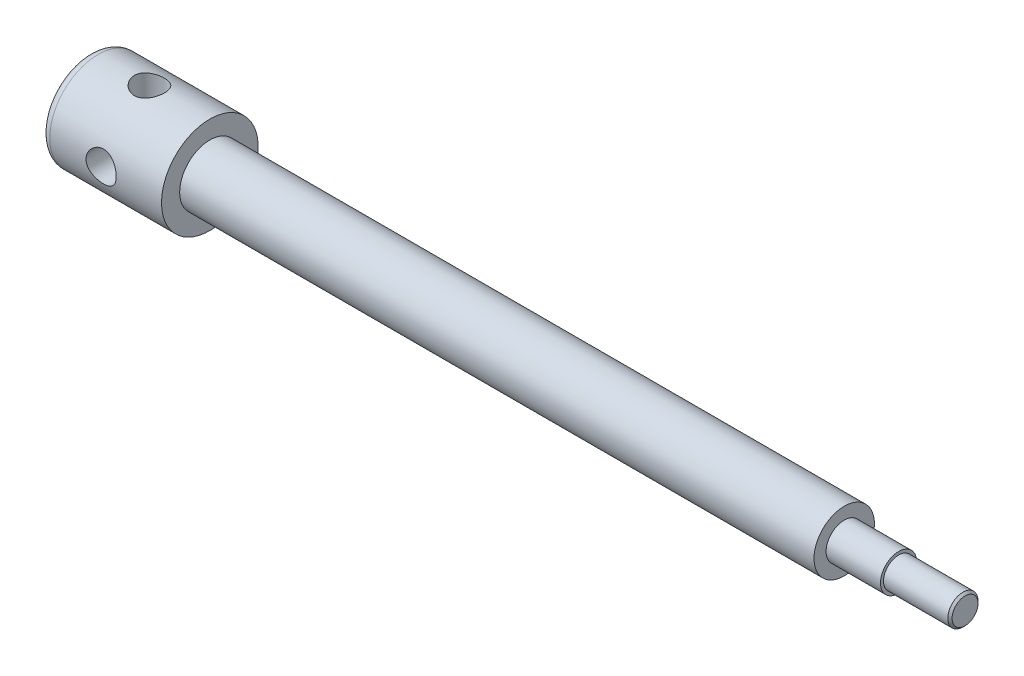
ISO-10303-21;
HEADER;
FILE_DESCRIPTION(('STEP AP214'),'2;1');
FILE_NAME('part.step','',(''),(''),'','','');
FILE_SCHEMA(('AUTOMOTIVE_DESIGN { 1 0 10303 214 1 1 1 1 }'));
ENDSEC;
DATA;
#1=APPLICATION_CONTEXT('core data for automotive mechanical design processes');
#2=APPLICATION_PROTOCOL_DEFINITION('international standard','automotive_design',2000,#1);
#3=PRODUCT_CONTEXT('',#1,'mechanical');
#4=PRODUCT('Part','Part','',(#3));
#5=PRODUCT_RELATED_PRODUCT_CATEGORY('part','',(#4));
#6=PRODUCT_DEFINITION_FORMATION('','',#4);
#7=PRODUCT_DEFINITION_CONTEXT('part definition',#1,'design');
#8=PRODUCT_DEFINITION('design','',#6,#7);
#9=PRODUCT_DEFINITION_SHAPE('','',#8);
#10=(LENGTH_UNIT() NAMED_UNIT(*) SI_UNIT(.MILLI.,.METRE.));
#11=(NAMED_UNIT(*) PLANE_ANGLE_UNIT() SI_UNIT($,.RADIAN.));
#12=(NAMED_UNIT(*) SI_UNIT($,.STERADIAN.) SOLID_ANGLE_UNIT());
#13=UNCERTAINTY_MEASURE_WITH_UNIT(LENGTH_MEASURE(1.E-05),#10,'distance_accuracy_value','');
#14=(GEOMETRIC_REPRESENTATION_CONTEXT(3) GLOBAL_UNCERTAINTY_ASSIGNED_CONTEXT((#13)) GLOBAL_UNIT_ASSIGNED_CONTEXT((#10,
#11,#12)) REPRESENTATION_CONTEXT('',''));
#15=CARTESIAN_POINT('',(0.,0.,0.));
#16=DIRECTION('',(0.,0.,1.));
#17=DIRECTION('',(1.,0.,0.));
#18=AXIS2_PLACEMENT_3D('',#15,#16,#17);
#19=CARTESIAN_POINT('',(-9.98454159103141,-50.,0.));
#20=DIRECTION('',(0.,1.,0.));
#21=DIRECTION('',(0.,0.,1.));
#22=AXIS2_PLACEMENT_3D('',#19,#20,#21);
#23=CYLINDRICAL_SURFACE('',#22,5.);
#24=CARTESIAN_POINT('',(-9.98454159103141,15.1986841535707,5.));
#25=CARTESIAN_POINT('',(-10.257929735483,15.1986858388479,4.99999815120853));
#26=CARTESIAN_POINT('',(-10.531336665848,15.206141260301,4.97750155166156));
#27=CARTESIAN_POINT('',(-11.0701182345388,15.2350255598558,4.8883670160513));
#28=CARTESIAN_POINT('',(-11.335490681959,15.2564582140989,4.82171715130012));
#29=CARTESIAN_POINT('',(-11.8503211987604,15.3106375534649,4.64679152894283));
#30=CARTESIAN_POINT('',(-12.0998065234544,15.3433642077798,4.5385894294672));
#31=CARTESIAN_POINT('',(-12.5771523744872,15.4164162487404,4.28387656692615));
#32=CARTESIAN_POINT('',(-12.8050090708718,15.4567429774317,4.13735903622524));
#33=CARTESIAN_POINT('',(-13.2404570610054,15.5420051067468,3.80478428248921));
#34=CARTESIAN_POINT('',(-13.4471960287754,15.5870449353917,3.6176375988816));
#35=CARTESIAN_POINT('',(-13.8269256438681,15.6757698344129,3.21144818582197));
#36=CARTESIAN_POINT('',(-13.9999115788108,15.7194547149049,2.99240101007426));
#37=CARTESIAN_POINT('',(-14.3109858430764,15.8017421356033,2.52250364997345));
#38=CARTESIAN_POINT('',(-14.4481964063572,15.8402073825112,2.27104622608038));
#39=CARTESIAN_POINT('',(-14.6780457904536,15.9065020733207,1.74721693141361));
#40=CARTESIAN_POINT('',(-14.7706950876298,15.9343340167968,1.47484999394821));
#41=CARTESIAN_POINT('',(-14.9059461034197,15.9754870328345,0.925857427864392));
#42=CARTESIAN_POINT('',(-14.9500045901828,15.9892295593657,0.649622861872864));
#43=CARTESIAN_POINT('',(-14.9914389767815,16.0021438350406,0.0933632559380779));
#44=CARTESIAN_POINT('',(-14.9888254884667,16.0013188964028,-0.186660907892346));
#45=CARTESIAN_POINT('',(-14.9379484246877,15.9854846453013,-0.732297921418927));
#46=CARTESIAN_POINT('',(-14.8912640569794,15.9709660388855,-0.998074537256133));
#47=CARTESIAN_POINT('',(-14.7561616308593,15.929979302435,-1.51781225339112));
#48=CARTESIAN_POINT('',(-14.6677408506849,15.9035103930884,-1.77177258192494));
#49=CARTESIAN_POINT('',(-14.4506608347322,15.8409383891783,-2.26431241261896));
#50=CARTESIAN_POINT('',(-14.3215223567804,15.8047213446668,-2.50266562249071));
#51=CARTESIAN_POINT('',(-14.0270571922121,15.7264689181539,-2.95481004460873));
#52=CARTESIAN_POINT('',(-13.8617213544759,15.6844320658262,-3.16859502483764));
#53=CARTESIAN_POINT('',(-13.4914470518306,15.5969468293413,-3.57495079381314));
#54=CARTESIAN_POINT('',(-13.285145315683,15.5514292793937,-3.76626619636764));
#55=CARTESIAN_POINT('',(-12.8429611837171,15.4636246177862,-4.11195897039057));
#56=CARTESIAN_POINT('',(-12.60707530867,15.4213378870279,-4.26633199104755));
#57=CARTESIAN_POINT('',(-12.1088717156411,15.3444338653158,-4.53521860076337));
#58=CARTESIAN_POINT('',(-11.8462879550675,15.3099076117639,-4.64926722799055));
#59=CARTESIAN_POINT('',(-11.3043036236634,15.253501811154,-4.83113383782183));
#60=CARTESIAN_POINT('',(-11.0249091342539,15.2316177207005,-4.89896843060006));
#61=CARTESIAN_POINT('',(-10.4692617807229,15.2039825362816,-4.9840594074562));
#62=CARTESIAN_POINT('',(-10.1933336060909,15.1976186557503,-5.00323817415589));
#63=CARTESIAN_POINT('',(-9.64218262505086,15.200043098397,-4.99586977992483));
#64=CARTESIAN_POINT('',(-9.36695971623275,15.2088290802927,-4.96932968445627));
#65=CARTESIAN_POINT('',(-8.83330840442172,15.2399582993567,-4.87299494052764));
#66=CARTESIAN_POINT('',(-8.57462449473461,15.2619021640805,-4.80447324642202));
#67=CARTESIAN_POINT('',(-8.07245442304808,15.3164514932552,-4.62761494644059));
#68=CARTESIAN_POINT('',(-7.82897074734688,15.3490586964925,-4.51927184684605));
#69=CARTESIAN_POINT('',(-7.35638515194418,15.4224215861294,-4.26230042623513));
#70=CARTESIAN_POINT('',(-7.12789592866025,15.4633841395902,-4.11260589954233));
#71=CARTESIAN_POINT('',(-6.69858020558381,15.5484139589123,-3.77842563471921));
#72=CARTESIAN_POINT('',(-6.49776091533008,15.5924820294279,-3.59393085876312));
#73=CARTESIAN_POINT('',(-6.12090012738014,15.6809675025074,-3.18629179101443));
#74=CARTESIAN_POINT('',(-5.94623044647195,15.7253236914272,-2.96186259915409));
#75=CARTESIAN_POINT('',(-5.6369774177464,15.8075623937471,-2.48580618260559));
#76=CARTESIAN_POINT('',(-5.50239223378727,15.8454452036378,-2.23418020443449));
#77=CARTESIAN_POINT('',(-5.27841934114469,15.9102524771405,-1.71242209332733));
#78=CARTESIAN_POINT('',(-5.18870443965668,15.937255982448,-1.44244073713503));
#79=CARTESIAN_POINT('',(-5.05625143667259,15.9776097059431,-0.890229016225556));
#80=CARTESIAN_POINT('',(-5.01349863469745,15.9909641965712,-0.608002513361416));
#81=CARTESIAN_POINT('',(-4.97737758403291,16.0022321361783,-0.0519397465956081));
#82=CARTESIAN_POINT('',(-4.98202779034833,16.0007651762951,0.221756767786049));
#83=CARTESIAN_POINT('',(-5.03578883522624,15.9840391232424,0.764292887693026));
#84=CARTESIAN_POINT('',(-5.08489677499939,15.9687809293064,1.03313280871841));
#85=CARTESIAN_POINT('',(-5.22491762792033,15.9263828337902,1.55502047392303));
#86=CARTESIAN_POINT('',(-5.31530002241222,15.899393918402,1.80822367379742));
#87=CARTESIAN_POINT('',(-5.53482489986599,15.8363178235242,2.29599370200086));
#88=CARTESIAN_POINT('',(-5.66397403092764,15.8002290836774,2.53055732509979));
#89=CARTESIAN_POINT('',(-5.96243262440656,15.7211958753111,2.98304677987682));
#90=CARTESIAN_POINT('',(-6.13295568087744,15.6780603899479,3.20013842820513));
#91=CARTESIAN_POINT('',(-6.50718114881514,15.590349461973,3.60328316560459));
#92=CARTESIAN_POINT('',(-6.71089348762582,15.5457735917315,3.78932693404399));
#93=CARTESIAN_POINT('',(-7.15380447036121,15.4584757027472,4.13131463642454));
#94=CARTESIAN_POINT('',(-7.3939552033608,15.4158640332118,4.28605711968617));
#95=CARTESIAN_POINT('',(-7.89813407198148,15.3392050100618,4.5528188298417));
#96=CARTESIAN_POINT('',(-8.16215249681869,15.3051541945183,4.66485533612217));
#97=CARTESIAN_POINT('',(-8.68343206030626,15.2522624175552,4.83484721745085));
#98=CARTESIAN_POINT('',(-8.93935178078733,15.2323726005924,4.89659759350261));
#99=CARTESIAN_POINT('',(-9.45835691934707,15.2055842579893,4.97916983261894));
#100=CARTESIAN_POINT('',(-9.72144055581366,15.1986825317074,5.00000177922474));
#101=CARTESIAN_POINT('',(-9.98454159103141,15.1986841535707,5.));
#102=B_SPLINE_CURVE_WITH_KNOTS('',3,(#24,#25,#26,#27,#28,#29,#30,#31,#32,#33,#34,#35,#36,#37,
#38,#39,#40,#41,#42,#43,#44,#45,#46,#47,#48,#49,#50,#51,#52,#53,#54,#55,#56,#57,#58,#59,#60,#61,
#62,#63,#64,#65,#66,#67,#68,#69,#70,#71,#72,#73,#74,#75,#76,#77,#78,#79,#80,#81,#82,#83,#84,#85,
#86,#87,#88,#89,#90,#91,#92,#93,#94,#95,#96,#97,#98,#99,#100,#101),.UNSPECIFIED.,.T.,.F.,(4,2,2,
2,2,2,2,2,2,2,2,2,2,2,2,2,2,2,2,2,2,2,2,2,2,2,2,2,2,2,2,2,2,2,2,2,2,2,4),(0.,0.819192550193962,
1.63860650823894,2.45657457647433,3.27468721969979,4.11828322203353,4.96199691764491,
5.82479287854933,6.68738589671688,7.52334891342135,8.35912185887098,9.16603931879003,
9.97300940760373,10.7898561843364,11.6069097085275,12.4580135574934,13.309217594151,
14.1699388374229,15.0303505582074,15.8561973316147,16.6819164888609,17.4837588818718,
18.2857320902257,19.1107045324817,19.9358915205725,20.7952775125577,21.6546241327807,
22.5076095717372,23.3603279257207,24.1775520976783,24.9947229877895,25.8016738606877,
26.6087631965634,27.4432277243059,28.2779423109849,29.1403118201788,30.002332032282,
30.7908941750129,31.5792619677388),.UNSPECIFIED.);
#103=CARTESIAN_POINT('',(-9.98454159103141,15.1986841535707,5.));
#104=VERTEX_POINT('',#103);
#105=EDGE_CURVE('E78',#104,#104,#102,.T.);
#106=ORIENTED_EDGE('',*,*,#105,.F.);
#107=EDGE_LOOP('',(#106));
#108=FACE_BOUND('',#107,.T.);
#109=CARTESIAN_POINT('',(-9.98454159103141,0.,0.));
#110=DIRECTION('',(0.,0.707106781186547,-0.707106781186547));
#111=DIRECTION('',(0.,0.707106781186547,0.707106781186547));
#112=AXIS2_PLACEMENT_3D('',#109,#110,#111);
#113=ELLIPSE('',#112,7.07106781186547,5.);
#114=CARTESIAN_POINT('',(-4.98454159103141,0.,0.));
#115=VERTEX_POINT('',#114);
#116=CARTESIAN_POINT('',(-14.9845415910314,0.,0.));
#117=VERTEX_POINT('',#116);
#118=EDGE_CURVE('E50',#115,#117,#113,.F.);
#119=ORIENTED_EDGE('',*,*,#118,.T.);
#120=CARTESIAN_POINT('',(-9.98454159103141,0.,0.));
#121=DIRECTION('',(0.,0.707106781186547,0.707106781186547));
#122=DIRECTION('',(0.,0.707106781186547,-0.707106781186547));
#123=AXIS2_PLACEMENT_3D('',#120,#121,#122);
#124=ELLIPSE('',#123,7.07106781186547,5.);
#125=EDGE_CURVE('E11',#117,#115,#124,.F.);
#126=ORIENTED_EDGE('',*,*,#125,.T.);
#127=EDGE_LOOP('',(#119,#126));
#128=FACE_BOUND('',#127,.T.);
#129=ADVANCED_FACE('F37',(#108,#128),#23,.F.);
#130=CARTESIAN_POINT('',(260.015458408969,4.29289321881348,0.));
#131=DIRECTION('',(-1.,0.,0.));
#132=DIRECTION('',(0.,0.,1.));
#133=AXIS2_PLACEMENT_3D('',#130,#131,#132);
#134=PLANE('',#133);
#135=CARTESIAN_POINT('',(260.015458408969,0.,0.));
#136=DIRECTION('',(-1.,0.,0.));
#137=DIRECTION('',(0.,0.,1.));
#138=AXIS2_PLACEMENT_3D('',#135,#136,#137);
#139=CIRCLE('',#138,4.29289321881348);
#140=CARTESIAN_POINT('',(260.015458408969,0.,4.29289321881348));
#141=VERTEX_POINT('',#140);
#142=EDGE_CURVE('E65',#141,#141,#139,.T.);
#143=ORIENTED_EDGE('',*,*,#142,.F.);
#144=EDGE_LOOP('',(#143));
#145=FACE_BOUND('',#144,.T.);
#146=ADVANCED_FACE('F39',(#145),#134,.F.);
#147=CARTESIAN_POINT('',(260.015458408969,0.,0.));
#148=DIRECTION('',(-1.,0.,0.));
#149=DIRECTION('',(0.,0.,1.));
#150=AXIS2_PLACEMENT_3D('',#147,#148,#149);
#151=CONICAL_SURFACE('',#150,4.29289321881348,0.785398163397389);
#152=CARTESIAN_POINT('',(259.308351627782,0.,0.));
#153=DIRECTION('',(-1.,0.,0.));
#154=DIRECTION('',(0.,0.,1.));
#155=AXIS2_PLACEMENT_3D('',#152,#153,#154);
#156=CIRCLE('',#155,5.00000000000002);
#157=CARTESIAN_POINT('',(259.308351627782,0.,5.00000000000002));
#158=VERTEX_POINT('',#157);
#159=EDGE_CURVE('E150',#158,#158,#156,.T.);
#160=ORIENTED_EDGE('',*,*,#159,.F.);
#161=EDGE_LOOP('',(#160));
#162=FACE_BOUND('',#161,.T.);
#163=ORIENTED_EDGE('',*,*,#142,.T.);
#164=EDGE_LOOP('',(#163));
#165=FACE_BOUND('',#164,.T.);
#166=ADVANCED_FACE('F110',(#162,#165),#151,.T.);
#167=CARTESIAN_POINT('',(-31.9453644398088,0.,0.));
#168=DIRECTION('',(-1.,0.,0.));
#169=DIRECTION('',(0.,0.,1.));
#170=AXIS2_PLACEMENT_3D('',#167,#168,#169);
#171=CYLINDRICAL_SURFACE('',#170,5.00000000000001);
#172=CARTESIAN_POINT('',(238.015458408969,0.,0.));
#173=DIRECTION('',(-1.,0.,0.));
#174=DIRECTION('',(0.,0.,1.));
#175=AXIS2_PLACEMENT_3D('',#172,#173,#174);
#176=CIRCLE('',#175,5.);
#177=CARTESIAN_POINT('',(238.015458408969,0.,5.));
#178=VERTEX_POINT('',#177);
#179=EDGE_CURVE('E147',#178,#178,#176,.T.);
#180=ORIENTED_EDGE('',*,*,#179,.F.);
#181=EDGE_LOOP('',(#180));
#182=FACE_BOUND('',#181,.T.);
#183=ORIENTED_EDGE('',*,*,#159,.T.);
#184=EDGE_LOOP('',(#183));
#185=FACE_BOUND('',#184,.T.);
#186=ADVANCED_FACE('F156',(#182,#185),#171,.T.);
#187=CARTESIAN_POINT('',(238.015458408969,6.,0.));
#188=DIRECTION('',(-1.,0.,0.));
#189=DIRECTION('',(0.,0.,1.));
#190=AXIS2_PLACEMENT_3D('',#187,#188,#189);
#191=PLANE('',#190);
#192=CARTESIAN_POINT('',(238.015458408969,0.,0.));
#193=DIRECTION('',(-1.,0.,0.));
#194=DIRECTION('',(0.,0.,1.));
#195=AXIS2_PLACEMENT_3D('',#192,#193,#194);
#196=CIRCLE('',#195,6.);
#197=CARTESIAN_POINT('',(238.015458408969,0.,6.));
#198=VERTEX_POINT('',#197);
#199=EDGE_CURVE('E144',#198,#198,#196,.T.);
#200=ORIENTED_EDGE('',*,*,#199,.F.);
#201=EDGE_LOOP('',(#200));
#202=FACE_BOUND('',#201,.T.);
#203=ORIENTED_EDGE('',*,*,#179,.T.);
#204=EDGE_LOOP('',(#203));
#205=FACE_BOUND('',#204,.T.);
#206=ADVANCED_FACE('F161',(#202,#205),#191,.F.);
#207=CARTESIAN_POINT('',(-31.9453644398088,0.,0.));
#208=DIRECTION('',(-1.,0.,0.));
#209=DIRECTION('',(0.,0.,1.));
#210=AXIS2_PLACEMENT_3D('',#207,#208,#209);
#211=CYLINDRICAL_SURFACE('',#210,6.);
#212=CARTESIAN_POINT('',(220.015458408969,0.,0.));
#213=DIRECTION('',(-1.,0.,0.));
#214=DIRECTION('',(0.,0.,1.));
#215=AXIS2_PLACEMENT_3D('',#212,#213,#214);
#216=CIRCLE('',#215,6.);
#217=CARTESIAN_POINT('',(220.015458408969,0.,6.));
#218=VERTEX_POINT('',#217);
#219=EDGE_CURVE('E141',#218,#218,#216,.T.);
#220=ORIENTED_EDGE('',*,*,#219,.F.);
#221=EDGE_LOOP('',(#220));
#222=FACE_BOUND('',#221,.T.);
#223=ORIENTED_EDGE('',*,*,#199,.T.);
#224=EDGE_LOOP('',(#223));
#225=FACE_BOUND('',#224,.T.);
#226=ADVANCED_FACE('F168',(#222,#225),#211,.T.);
#227=CARTESIAN_POINT('',(220.015458408969,6.,0.));
#228=DIRECTION('',(-1.,0.,0.));
#229=DIRECTION('',(0.,0.,1.));
#230=AXIS2_PLACEMENT_3D('',#227,#228,#229);
#231=PLANE('',#230);
#232=CARTESIAN_POINT('',(220.015458408969,0.,0.));
#233=DIRECTION('',(-1.,0.,0.));
#234=DIRECTION('',(0.,0.,1.));
#235=AXIS2_PLACEMENT_3D('',#232,#233,#234);
#236=CIRCLE('',#235,9.99835911782587);
#237=CARTESIAN_POINT('',(220.015458408969,0.,9.99835911782587));
#238=VERTEX_POINT('',#237);
#239=EDGE_CURVE('E138',#238,#238,#236,.T.);
#240=ORIENTED_EDGE('',*,*,#239,.F.);
#241=EDGE_LOOP('',(#240));
#242=FACE_BOUND('',#241,.T.);
#243=ORIENTED_EDGE('',*,*,#219,.T.);
#244=EDGE_LOOP('',(#243));
#245=FACE_BOUND('',#244,.T.);
#246=ADVANCED_FACE('F172',(#242,#245),#231,.F.);
#247=CARTESIAN_POINT('',(-31.9453644398088,0.,0.));
#248=DIRECTION('',(-1.,0.,0.));
#249=DIRECTION('',(0.,0.,1.));
#250=AXIS2_PLACEMENT_3D('',#247,#248,#249);
#251=CYLINDRICAL_SURFACE('',#250,9.99835911782585);
#252=CARTESIAN_POINT('',(10.0154584089686,0.,0.));
#253=DIRECTION('',(-1.,0.,0.));
#254=DIRECTION('',(0.,0.,1.));
#255=AXIS2_PLACEMENT_3D('',#252,#253,#254);
#256=CIRCLE('',#255,9.99835911782584);
#257=CARTESIAN_POINT('',(10.0154584089686,0.,9.99835911782584));
#258=VERTEX_POINT('',#257);
#259=EDGE_CURVE('E135',#258,#258,#256,.T.);
#260=ORIENTED_EDGE('',*,*,#259,.F.);
#261=EDGE_LOOP('',(#260));
#262=FACE_BOUND('',#261,.T.);
#263=ORIENTED_EDGE('',*,*,#239,.T.);
#264=EDGE_LOOP('',(#263));
#265=FACE_BOUND('',#264,.T.);
#266=ADVANCED_FACE('F176',(#262,#265),#251,.T.);
#267=CARTESIAN_POINT('',(10.0154584089686,9.99835911782584,0.));
#268=DIRECTION('',(-1.,0.,0.));
#269=DIRECTION('',(0.,0.,1.));
#270=AXIS2_PLACEMENT_3D('',#267,#268,#269);
#271=PLANE('',#270);
#272=CARTESIAN_POINT('',(10.0154584089686,0.,0.));
#273=DIRECTION('',(-1.,0.,0.));
#274=DIRECTION('',(0.,0.,1.));
#275=AXIS2_PLACEMENT_3D('',#272,#273,#274);
#276=CIRCLE('',#275,16.);
#277=CARTESIAN_POINT('',(10.0154584089686,0.,16.));
#278=VERTEX_POINT('',#277);
#279=EDGE_CURVE('E132',#278,#278,#276,.T.);
#280=ORIENTED_EDGE('',*,*,#279,.F.);
#281=EDGE_LOOP('',(#280));
#282=FACE_BOUND('',#281,.T.);
#283=ORIENTED_EDGE('',*,*,#259,.T.);
#284=EDGE_LOOP('',(#283));
#285=FACE_BOUND('',#284,.T.);
#286=ADVANCED_FACE('F101',(#282,#285),#271,.F.);
#287=CARTESIAN_POINT('',(-31.9453644398088,0.,0.));
#288=DIRECTION('',(-1.,0.,0.));
#289=DIRECTION('',(0.,0.,1.));
#290=AXIS2_PLACEMENT_3D('',#287,#288,#289);
#291=CYLINDRICAL_SURFACE('',#290,16.);
#292=CARTESIAN_POINT('',(-4.98454159103141,0.,16.));
#293=CARTESIAN_POINT('',(-4.98454337738171,-0.273756740698179,15.9999986351195));
#294=CARTESIAN_POINT('',(-5.00709849880919,-0.54753221001141,15.9929077993933));
#295=CARTESIAN_POINT('',(-5.0964865571884,-1.08707683835382,15.9653157635526));
#296=CARTESIAN_POINT('',(-5.16332951648899,-1.35284417090373,15.9448115279957));
#297=CARTESIAN_POINT('',(-5.33881907581422,-1.86851417460313,15.892632627915));
#298=CARTESIAN_POINT('',(-5.44740096964276,-2.11844070794284,15.860975259956));
#299=CARTESIAN_POINT('',(-5.70301086174525,-2.59653920938622,15.7897587664487));
#300=CARTESIAN_POINT('',(-5.85004491815572,-2.82470774178094,15.7501983960149));
#301=CARTESIAN_POINT('',(-6.18316555909884,-3.25986133980768,15.6660085495921));
#302=CARTESIAN_POINT('',(-6.3702251312681,-3.46608011262119,15.621268637007));
#303=CARTESIAN_POINT('',(-6.77601516069321,-3.84478952815342,15.5324018550409));
#304=CARTESIAN_POINT('',(-6.99475150103799,-4.01727389161514,15.4882751012093));
#305=CARTESIAN_POINT('',(-7.46431984623873,-4.32777345930637,15.4044457876484));
#306=CARTESIAN_POINT('',(-7.71581150103912,-4.4648313659311,15.3648795310221));
#307=CARTESIAN_POINT('',(-8.23971085085404,-4.69438964299238,15.2963120709366));
#308=CARTESIAN_POINT('',(-8.51211301417483,-4.78690175085853,15.2673080849026));
#309=CARTESIAN_POINT('',(-9.06145390086511,-4.92193839721856,15.224304279618));
#310=CARTESIAN_POINT('',(-9.33800896559961,-4.96588440031618,15.2098789171452));
#311=CARTESIAN_POINT('',(-9.89491406666621,-5.00698220147793,15.1964022056731));
#312=CARTESIAN_POINT('',(-10.1752630742924,-5.00414643984172,15.1973467694717));
#313=CARTESIAN_POINT('',(-10.7200394321425,-4.95287298929817,15.2141275626545));
#314=CARTESIAN_POINT('',(-10.9846580945834,-4.90624231472934,15.2293736684469));
#315=CARTESIAN_POINT('',(-11.5021102172804,-4.77163253417961,15.272081024701));
#316=CARTESIAN_POINT('',(-11.7549424218897,-4.68364903377187,15.2995435733467));
#317=CARTESIAN_POINT('',(-12.2459493687298,-4.46755498726522,15.3640417609541));
#318=CARTESIAN_POINT('',(-12.4838560337907,-4.33887702648707,15.4012113865356));
#319=CARTESIAN_POINT('',(-12.9352926625565,-4.04544082951013,15.4808742631002));
#320=CARTESIAN_POINT('',(-13.1488162720486,-3.88067322086205,15.523368895754));
#321=CARTESIAN_POINT('',(-13.5556413646969,-3.51086781672958,15.6112611120491));
#322=CARTESIAN_POINT('',(-13.7475798221495,-3.30433828237156,15.6567027842357));
#323=CARTESIAN_POINT('',(-14.0944291653508,-2.86145763238183,15.7436628303753));
#324=CARTESIAN_POINT('',(-14.2493373079084,-2.625104309396,15.7851809135328));
#325=CARTESIAN_POINT('',(-14.5186523454363,-2.12665844186189,15.8600517956098));
#326=CARTESIAN_POINT('',(-14.6327341328872,-1.86437962767714,15.8933384259289));
#327=CARTESIAN_POINT('',(-14.8147535944377,-1.32307191113056,15.9475182331416));
#328=CARTESIAN_POINT('',(-14.882705279985,-1.04404812289843,15.9684151730059));
#329=CARTESIAN_POINT('',(-14.9682137613473,-0.488740629161383,15.9948555758007));
#330=CARTESIAN_POINT('',(-14.9876157654055,-0.212767395155372,16.0009609158175));
#331=CARTESIAN_POINT('',(-14.9806766844821,0.338521222930347,15.9987919892393));
#332=CARTESIAN_POINT('',(-14.954342281741,0.613836697226038,15.9905198232454));
#333=CARTESIAN_POINT('',(-14.8581592206059,1.1488773319034,15.9608945507905));
#334=CARTESIAN_POINT('',(-14.7894085205815,1.40881991368375,15.9398717244275));
#335=CARTESIAN_POINT('',(-14.6116841815646,1.91340771544551,15.8872048551716));
#336=CARTESIAN_POINT('',(-14.5027055749314,2.15805104179624,15.8555595005737));
#337=CARTESIAN_POINT('',(-14.2446487248367,2.63172962668875,15.783941710377));
#338=CARTESIAN_POINT('',(-14.0946576410442,2.86023895915116,15.7437850727067));
#339=CARTESIAN_POINT('',(-13.7599287505617,3.28946340384104,15.6597364001372));
#340=CARTESIAN_POINT('',(-13.5751815200528,3.4901709521758,15.6158433539155));
#341=CARTESIAN_POINT('',(-13.167506030823,3.86634985167608,15.5270797953257));
#342=CARTESIAN_POINT('',(-12.9433549360745,4.04050609358125,15.4822394682577));
#343=CARTESIAN_POINT('',(-12.4680351255243,4.34885000980606,15.3984778838242));
#344=CARTESIAN_POINT('',(-12.2168668389235,4.48303831893719,15.3595565324524));
#345=CARTESIAN_POINT('',(-11.6951608995495,4.70680333922169,15.2924712932348));
#346=CARTESIAN_POINT('',(-11.4247029932885,4.7965527822405,15.264265854275));
#347=CARTESIAN_POINT('',(-10.8714516180369,4.92891577272361,15.2220468337724));
#348=CARTESIAN_POINT('',(-10.5886628856573,4.97154725655978,15.2080278520491));
#349=CARTESIAN_POINT('',(-10.0325252407097,5.00717624632503,15.1963317085551));
#350=CARTESIAN_POINT('',(-9.75932777564174,5.00233118486543,15.1979441840057));
#351=CARTESIAN_POINT('',(-9.21784325126366,4.94835272515335,15.2156036150361));
#352=CARTESIAN_POINT('',(-8.94955596348447,4.89922139290048,15.2316498972642));
#353=CARTESIAN_POINT('',(-8.42936543266384,4.7595091965447,15.2758725673356));
#354=CARTESIAN_POINT('',(-8.17727982665797,4.66954569624033,15.3038679276103));
#355=CARTESIAN_POINT('',(-7.69157993689539,4.45120909339998,15.3687881701826));
#356=CARTESIAN_POINT('',(-7.45796942271779,4.32282817776947,15.4057148685869));
#357=CARTESIAN_POINT('',(-7.00595770927216,4.02542700053973,15.4861394813401));
#358=CARTESIAN_POINT('',(-6.78850907303046,3.85501334096529,15.5298379569183));
#359=CARTESIAN_POINT('',(-6.38459627858342,3.4808359856192,15.6179599528484));
#360=CARTESIAN_POINT('',(-6.19814043506718,3.27706336937756,15.6623836642662));
#361=CARTESIAN_POINT('',(-5.85541143757969,2.83394665129338,15.7486908780989));
#362=CARTESIAN_POINT('',(-5.70032264523161,2.59365829794954,15.7904440692269));
#363=CARTESIAN_POINT('',(-5.4329459304736,2.0891165520546,15.8650707718751));
#364=CARTESIAN_POINT('',(-5.32064118246407,1.82487263118179,15.8979477726329));
#365=CARTESIAN_POINT('',(-5.15017612059756,1.30299054149591,15.9488260293388));
#366=CARTESIAN_POINT('',(-5.08824212181006,1.04668134845018,15.9678496322456));
#367=CARTESIAN_POINT('',(-5.00542815116056,0.526919581760987,15.9934360136194));
#368=CARTESIAN_POINT('',(-4.98453987181541,0.263468464558691,16.0000013135858));
#369=CARTESIAN_POINT('',(-4.98454159103141,0.,16.));
#370=B_SPLINE_CURVE_WITH_KNOTS('',3,(#292,#293,#294,#295,#296,#297,#298,#299,#300,#301,#302,
#303,#304,#305,#306,#307,#308,#309,#310,#311,#312,#313,#314,#315,#316,#317,#318,#319,#320,#321,
#322,#323,#324,#325,#326,#327,#328,#329,#330,#331,#332,#333,#334,#335,#336,#337,#338,#339,#340,
#341,#342,#343,#344,#345,#346,#347,#348,#349,#350,#351,#352,#353,#354,#355,#356,#357,#358,#359,
#360,#361,#362,#363,#364,#365,#366,#367,#368,#369),.UNSPECIFIED.,.T.,.F.,(4,2,2,2,2,2,2,2,2,2,2,
2,2,2,2,2,2,2,2,2,2,2,2,2,2,2,2,2,2,2,2,2,2,2,2,2,2,2,4),(0.,0.82030179773004,1.64078929339627,
2.46000991680975,3.27935968623357,4.12151288780633,4.96382269725105,5.82695084991452,
6.68985145121464,7.52676600672195,8.36345801183909,9.16707669695194,9.97078079925601,
10.7862257089153,11.6018826405078,12.4546698912775,13.3075202966256,14.1670184276843,
15.0262553798757,15.852302742023,16.678229426068,17.4836250690084,18.2891202014735,
19.1142529896272,19.9396098284639,20.7976711486191,21.655718839442,22.5104046302277,
23.3647649559871,24.1804881394266,24.9961732705188,25.7999165363423,26.6038233736824,
27.4391805607299,28.274761495409,29.1376267255319,30.0001522671289,30.7897854665371,
31.5792588309973),.UNSPECIFIED.);
#371=CARTESIAN_POINT('',(-4.98454159103141,0.,16.));
#372=VERTEX_POINT('',#371);
#373=EDGE_CURVE('E115',#372,#372,#370,.T.);
#374=ORIENTED_EDGE('',*,*,#373,.T.);
#375=EDGE_LOOP('',(#374));
#376=FACE_BOUND('',#375,.T.);
#377=CARTESIAN_POINT('',(-4.98454159103141,0.,-16.));
#378=CARTESIAN_POINT('',(-4.98454337738171,0.273756740698179,-15.9999986351195));
#379=CARTESIAN_POINT('',(-5.00709849880919,0.54753221001141,-15.9929077993933));
#380=CARTESIAN_POINT('',(-5.0964865571884,1.08707683835382,-15.9653157635526));
#381=CARTESIAN_POINT('',(-5.16332951648899,1.35284417090373,-15.9448115279957));
#382=CARTESIAN_POINT('',(-5.33881907581422,1.86851417460313,-15.892632627915));
#383=CARTESIAN_POINT('',(-5.44740096964276,2.11844070794284,-15.860975259956));
#384=CARTESIAN_POINT('',(-5.70301086174525,2.59653920938622,-15.7897587664487));
#385=CARTESIAN_POINT('',(-5.85004491815572,2.82470774178094,-15.7501983960149));
#386=CARTESIAN_POINT('',(-6.18316555909884,3.25986133980768,-15.6660085495921));
#387=CARTESIAN_POINT('',(-6.3702251312681,3.46608011262119,-15.621268637007));
#388=CARTESIAN_POINT('',(-6.77601516069321,3.84478952815342,-15.5324018550409));
#389=CARTESIAN_POINT('',(-6.99475150103799,4.01727389161514,-15.4882751012093));
#390=CARTESIAN_POINT('',(-7.46431984623873,4.32777345930637,-15.4044457876484));
#391=CARTESIAN_POINT('',(-7.71581150103912,4.4648313659311,-15.3648795310221));
#392=CARTESIAN_POINT('',(-8.23971085085404,4.69438964299238,-15.2963120709366));
#393=CARTESIAN_POINT('',(-8.51211301417483,4.78690175085853,-15.2673080849026));
#394=CARTESIAN_POINT('',(-9.06145390086511,4.92193839721856,-15.224304279618));
#395=CARTESIAN_POINT('',(-9.33800896559961,4.96588440031618,-15.2098789171452));
#396=CARTESIAN_POINT('',(-9.89491406666621,5.00698220147793,-15.1964022056731));
#397=CARTESIAN_POINT('',(-10.1752630742924,5.00414643984172,-15.1973467694717));
#398=CARTESIAN_POINT('',(-10.7200394321425,4.95287298929817,-15.2141275626545));
#399=CARTESIAN_POINT('',(-10.9846580945834,4.90624231472934,-15.2293736684469));
#400=CARTESIAN_POINT('',(-11.5021102172804,4.77163253417961,-15.272081024701));
#401=CARTESIAN_POINT('',(-11.7549424218897,4.68364903377187,-15.2995435733467));
#402=CARTESIAN_POINT('',(-12.2459493687298,4.46755498726522,-15.3640417609541));
#403=CARTESIAN_POINT('',(-12.4838560337907,4.33887702648707,-15.4012113865356));
#404=CARTESIAN_POINT('',(-12.9352926625565,4.04544082951013,-15.4808742631002));
#405=CARTESIAN_POINT('',(-13.1488162720486,3.88067322086205,-15.523368895754));
#406=CARTESIAN_POINT('',(-13.5556413646969,3.51086781672958,-15.6112611120491));
#407=CARTESIAN_POINT('',(-13.7475798221495,3.30433828237156,-15.6567027842357));
#408=CARTESIAN_POINT('',(-14.0944291653508,2.86145763238183,-15.7436628303753));
#409=CARTESIAN_POINT('',(-14.2493373079084,2.625104309396,-15.7851809135328));
#410=CARTESIAN_POINT('',(-14.5186523454363,2.12665844186189,-15.8600517956098));
#411=CARTESIAN_POINT('',(-14.6327341328872,1.86437962767714,-15.8933384259289));
#412=CARTESIAN_POINT('',(-14.8147535944377,1.32307191113056,-15.9475182331416));
#413=CARTESIAN_POINT('',(-14.882705279985,1.04404812289843,-15.9684151730059));
#414=CARTESIAN_POINT('',(-14.9682137613473,0.488740629161383,-15.9948555758007));
#415=CARTESIAN_POINT('',(-14.9876157654055,0.212767395155372,-16.0009609158175));
#416=CARTESIAN_POINT('',(-14.9806766844821,-0.338521222930347,-15.9987919892393));
#417=CARTESIAN_POINT('',(-14.954342281741,-0.613836697226038,-15.9905198232454));
#418=CARTESIAN_POINT('',(-14.8581592206059,-1.1488773319034,-15.9608945507905));
#419=CARTESIAN_POINT('',(-14.7894085205815,-1.40881991368375,-15.9398717244275));
#420=CARTESIAN_POINT('',(-14.6116841815646,-1.91340771544551,-15.8872048551716));
#421=CARTESIAN_POINT('',(-14.5027055749314,-2.15805104179624,-15.8555595005737));
#422=CARTESIAN_POINT('',(-14.2446487248367,-2.63172962668875,-15.783941710377));
#423=CARTESIAN_POINT('',(-14.0946576410442,-2.86023895915116,-15.7437850727067));
#424=CARTESIAN_POINT('',(-13.7599287505617,-3.28946340384104,-15.6597364001372));
#425=CARTESIAN_POINT('',(-13.5751815200528,-3.4901709521758,-15.6158433539155));
#426=CARTESIAN_POINT('',(-13.167506030823,-3.86634985167608,-15.5270797953257));
#427=CARTESIAN_POINT('',(-12.9433549360745,-4.04050609358125,-15.4822394682577));
#428=CARTESIAN_POINT('',(-12.4680351255243,-4.34885000980606,-15.3984778838242));
#429=CARTESIAN_POINT('',(-12.2168668389235,-4.48303831893719,-15.3595565324524));
#430=CARTESIAN_POINT('',(-11.6951608995495,-4.70680333922169,-15.2924712932348));
#431=CARTESIAN_POINT('',(-11.4247029932885,-4.7965527822405,-15.264265854275));
#432=CARTESIAN_POINT('',(-10.8714516180369,-4.92891577272361,-15.2220468337724));
#433=CARTESIAN_POINT('',(-10.5886628856573,-4.97154725655978,-15.2080278520491));
#434=CARTESIAN_POINT('',(-10.0325252407097,-5.00717624632503,-15.1963317085551));
#435=CARTESIAN_POINT('',(-9.75932777564174,-5.00233118486543,-15.1979441840057));
#436=CARTESIAN_POINT('',(-9.21784325126366,-4.94835272515335,-15.2156036150361));
#437=CARTESIAN_POINT('',(-8.94955596348447,-4.89922139290048,-15.2316498972642));
#438=CARTESIAN_POINT('',(-8.42936543266384,-4.7595091965447,-15.2758725673356));
#439=CARTESIAN_POINT('',(-8.17727982665797,-4.66954569624033,-15.3038679276103));
#440=CARTESIAN_POINT('',(-7.69157993689539,-4.45120909339998,-15.3687881701826));
#441=CARTESIAN_POINT('',(-7.45796942271779,-4.32282817776947,-15.4057148685869));
#442=CARTESIAN_POINT('',(-7.00595770927216,-4.02542700053973,-15.4861394813401));
#443=CARTESIAN_POINT('',(-6.78850907303046,-3.85501334096529,-15.5298379569183));
#444=CARTESIAN_POINT('',(-6.38459627858342,-3.4808359856192,-15.6179599528484));
#445=CARTESIAN_POINT('',(-6.19814043506718,-3.27706336937756,-15.6623836642662));
#446=CARTESIAN_POINT('',(-5.85541143757969,-2.83394665129338,-15.7486908780989));
#447=CARTESIAN_POINT('',(-5.70032264523161,-2.59365829794954,-15.7904440692269));
#448=CARTESIAN_POINT('',(-5.4329459304736,-2.0891165520546,-15.8650707718751));
#449=CARTESIAN_POINT('',(-5.32064118246407,-1.82487263118179,-15.8979477726329));
#450=CARTESIAN_POINT('',(-5.15017612059756,-1.30299054149591,-15.9488260293388));
#451=CARTESIAN_POINT('',(-5.08824212181006,-1.04668134845018,-15.9678496322456));
#452=CARTESIAN_POINT('',(-5.00542815116056,-0.526919581760987,-15.9934360136194));
#453=CARTESIAN_POINT('',(-4.98453987181541,-0.263468464558691,-16.0000013135858));
#454=CARTESIAN_POINT('',(-4.98454159103141,0.,-16.));
#455=B_SPLINE_CURVE_WITH_KNOTS('',3,(#377,#378,#379,#380,#381,#382,#383,#384,#385,#386,#387,
#388,#389,#390,#391,#392,#393,#394,#395,#396,#397,#398,#399,#400,#401,#402,#403,#404,#405,#406,
#407,#408,#409,#410,#411,#412,#413,#414,#415,#416,#417,#418,#419,#420,#421,#422,#423,#424,#425,
#426,#427,#428,#429,#430,#431,#432,#433,#434,#435,#436,#437,#438,#439,#440,#441,#442,#443,#444,
#445,#446,#447,#448,#449,#450,#451,#452,#453,#454),.UNSPECIFIED.,.T.,.F.,(4,2,2,2,2,2,2,2,2,2,2,
2,2,2,2,2,2,2,2,2,2,2,2,2,2,2,2,2,2,2,2,2,2,2,2,2,2,2,4),(0.,0.82030179773004,1.64078929339627,
2.46000991680975,3.27935968623357,4.12151288780633,4.96382269725105,5.82695084991452,
6.68985145121464,7.52676600672195,8.36345801183909,9.16707669695194,9.97078079925601,
10.7862257089153,11.6018826405078,12.4546698912775,13.3075202966256,14.1670184276843,
15.0262553798757,15.852302742023,16.678229426068,17.4836250690084,18.2891202014735,
19.1142529896272,19.9396098284639,20.7976711486191,21.655718839442,22.5104046302277,
23.3647649559871,24.1804881394266,24.9961732705188,25.7999165363423,26.6038233736824,
27.4391805607299,28.274761495409,29.1376267255319,30.0001522671289,30.7897854665371,
31.5792588309973),.UNSPECIFIED.);
#456=CARTESIAN_POINT('',(-4.98454159103141,0.,-16.));
#457=VERTEX_POINT('',#456);
#458=EDGE_CURVE('E117',#457,#457,#455,.T.);
#459=ORIENTED_EDGE('',*,*,#458,.T.);
#460=EDGE_LOOP('',(#459));
#461=FACE_BOUND('',#460,.T.);
#462=CARTESIAN_POINT('',(-9.98454159103141,-15.1986841535707,5.));
#463=CARTESIAN_POINT('',(-9.71115344657986,-15.1986858388479,4.99999815120853));
#464=CARTESIAN_POINT('',(-9.4377465162148,-15.206141260301,4.97750155166156));
#465=CARTESIAN_POINT('',(-8.89896494752399,-15.2350255598558,4.8883670160513));
#466=CARTESIAN_POINT('',(-8.63359250010379,-15.2564582140989,4.82171715130012));
#467=CARTESIAN_POINT('',(-8.1187619833024,-15.3106375534649,4.64679152894283));
#468=CARTESIAN_POINT('',(-7.86927665860842,-15.3433642077798,4.5385894294672));
#469=CARTESIAN_POINT('',(-7.39193080757563,-15.4164162487404,4.28387656692615));
#470=CARTESIAN_POINT('',(-7.164074111191,-15.4567429774317,4.13735903622524));
#471=CARTESIAN_POINT('',(-6.72862612105739,-15.5420051067468,3.80478428248921));
#472=CARTESIAN_POINT('',(-6.52188715328745,-15.5870449353917,3.6176375988816));
#473=CARTESIAN_POINT('',(-6.14215753819469,-15.6757698344129,3.21144818582197));
#474=CARTESIAN_POINT('',(-5.96917160325203,-15.7194547149049,2.99240101007426));
#475=CARTESIAN_POINT('',(-5.65809733898643,-15.8017421356033,2.52250364997345));
#476=CARTESIAN_POINT('',(-5.52088677570559,-15.8402073825112,2.27104622608038));
#477=CARTESIAN_POINT('',(-5.29103739160922,-15.9065020733207,1.74721693141361));
#478=CARTESIAN_POINT('',(-5.19838809443307,-15.9343340167968,1.47484999394821));
#479=CARTESIAN_POINT('',(-5.06313707864313,-15.9754870328345,0.925857427864392));
#480=CARTESIAN_POINT('',(-5.01907859188001,-15.9892295593657,0.649622861872864));
#481=CARTESIAN_POINT('',(-4.97764420528132,-16.0021438350406,0.0933632559380778));
#482=CARTESIAN_POINT('',(-4.98025769359612,-16.0013188964028,-0.186660907892346));
#483=CARTESIAN_POINT('',(-5.03113475737517,-15.9854846453013,-0.732297921418927));
#484=CARTESIAN_POINT('',(-5.07781912508342,-15.9709660388855,-0.998074537256132));
#485=CARTESIAN_POINT('',(-5.21292155120349,-15.929979302435,-1.51781225339112));
#486=CARTESIAN_POINT('',(-5.30134233137792,-15.9035103930884,-1.77177258192494));
#487=CARTESIAN_POINT('',(-5.51842234733066,-15.8409383891783,-2.26431241261896));
#488=CARTESIAN_POINT('',(-5.64756082528243,-15.8047213446668,-2.50266562249071));
#489=CARTESIAN_POINT('',(-5.94202598985077,-15.7264689181539,-2.95481004460873));
#490=CARTESIAN_POINT('',(-6.1073618275869,-15.6844320658262,-3.16859502483764));
#491=CARTESIAN_POINT('',(-6.47763613023227,-15.5969468293413,-3.57495079381314));
#492=CARTESIAN_POINT('',(-6.68393786637978,-15.5514292793937,-3.76626619636765));
#493=CARTESIAN_POINT('',(-7.12612199834569,-15.4636246177862,-4.11195897039057));
#494=CARTESIAN_POINT('',(-7.36200787339283,-15.4213378870279,-4.26633199104755));
#495=CARTESIAN_POINT('',(-7.86021146642171,-15.3444338653158,-4.53521860076337));
#496=CARTESIAN_POINT('',(-8.1227952269953,-15.3099076117639,-4.64926722799055));
#497=CARTESIAN_POINT('',(-8.66477955839944,-15.253501811154,-4.83113383782183));
#498=CARTESIAN_POINT('',(-8.94417404780891,-15.2316177207005,-4.89896843060006));
#499=CARTESIAN_POINT('',(-9.49982140133997,-15.2039825362816,-4.9840594074562));
#500=CARTESIAN_POINT('',(-9.77574957597195,-15.1976186557503,-5.00323817415588));
#501=CARTESIAN_POINT('',(-10.326900557012,-15.200043098397,-4.99586977992483));
#502=CARTESIAN_POINT('',(-10.6021234658301,-15.2088290802927,-4.96932968445627));
#503=CARTESIAN_POINT('',(-11.1357747776411,-15.2399582993566,-4.87299494052764));
#504=CARTESIAN_POINT('',(-11.3944586873282,-15.2619021640804,-4.80447324642202));
#505=CARTESIAN_POINT('',(-11.8966287590148,-15.3164514932552,-4.62761494644059));
#506=CARTESIAN_POINT('',(-12.1401124347159,-15.3490586964925,-4.51927184684605));
#507=CARTESIAN_POINT('',(-12.6126980301186,-15.4224215861294,-4.26230042623513));
#508=CARTESIAN_POINT('',(-12.8411872534026,-15.4633841395902,-4.11260589954233));
#509=CARTESIAN_POINT('',(-13.270502976479,-15.5484139589123,-3.77842563471921));
#510=CARTESIAN_POINT('',(-13.4713222667327,-15.5924820294279,-3.59393085876312));
#511=CARTESIAN_POINT('',(-13.8481830546827,-15.6809675025074,-3.18629179101443));
#512=CARTESIAN_POINT('',(-14.0228527355909,-15.7253236914272,-2.96186259915409));
#513=CARTESIAN_POINT('',(-14.3321057643164,-15.8075623937471,-2.48580618260559));
#514=CARTESIAN_POINT('',(-14.4666909482756,-15.8454452036378,-2.23418020443449));
#515=CARTESIAN_POINT('',(-14.6906638409181,-15.9102524771405,-1.71242209332733));
#516=CARTESIAN_POINT('',(-14.7803787424061,-15.937255982448,-1.44244073713503));
#517=CARTESIAN_POINT('',(-14.9128317453902,-15.9776097059431,-0.890229016225556));
#518=CARTESIAN_POINT('',(-14.9555845473654,-15.9909641965712,-0.608002513361416));
#519=CARTESIAN_POINT('',(-14.9917055980299,-16.0022321361783,-0.0519397465956067));
#520=CARTESIAN_POINT('',(-14.9870553917145,-16.0007651762951,0.221756767786051));
#521=CARTESIAN_POINT('',(-14.9332943468366,-15.9840391232424,0.764292887693028));
#522=CARTESIAN_POINT('',(-14.8841864070634,-15.9687809293064,1.03313280871841));
#523=CARTESIAN_POINT('',(-14.7441655541425,-15.9263828337902,1.55502047392303));
#524=CARTESIAN_POINT('',(-14.6537831596506,-15.899393918402,1.80822367379742));
#525=CARTESIAN_POINT('',(-14.4342582821968,-15.8363178235242,2.29599370200086));
#526=CARTESIAN_POINT('',(-14.3051091511352,-15.8002290836774,2.53055732509979));
#527=CARTESIAN_POINT('',(-14.0066505576563,-15.7211958753111,2.98304677987682));
#528=CARTESIAN_POINT('',(-13.8361275011854,-15.6780603899479,3.20013842820513));
#529=CARTESIAN_POINT('',(-13.4619020332477,-15.590349461973,3.60328316560459));
#530=CARTESIAN_POINT('',(-13.258189694437,-15.5457735917315,3.78932693404398));
#531=CARTESIAN_POINT('',(-12.8152787117016,-15.4584757027472,4.13131463642454));
#532=CARTESIAN_POINT('',(-12.575127978702,-15.4158640332118,4.28605711968617));
#533=CARTESIAN_POINT('',(-12.0709491100813,-15.3392050100618,4.5528188298417));
#534=CARTESIAN_POINT('',(-11.8069306852441,-15.3051541945183,4.66485533612217));
#535=CARTESIAN_POINT('',(-11.2856511217566,-15.2522624175552,4.83484721745085));
#536=CARTESIAN_POINT('',(-11.0297314012755,-15.2323726005924,4.89659759350261));
#537=CARTESIAN_POINT('',(-10.5107262627158,-15.2055842579893,4.97916983261894));
#538=CARTESIAN_POINT('',(-10.2476426262492,-15.1986825317074,5.00000177922474));
#539=CARTESIAN_POINT('',(-9.98454159103141,-15.1986841535707,5.));
#540=B_SPLINE_CURVE_WITH_KNOTS('',3,(#462,#463,#464,#465,#466,#467,#468,#469,#470,#471,#472,
#473,#474,#475,#476,#477,#478,#479,#480,#481,#482,#483,#484,#485,#486,#487,#488,#489,#490,#491,
#492,#493,#494,#495,#496,#497,#498,#499,#500,#501,#502,#503,#504,#505,#506,#507,#508,#509,#510,
#511,#512,#513,#514,#515,#516,#517,#518,#519,#520,#521,#522,#523,#524,#525,#526,#527,#528,#529,
#530,#531,#532,#533,#534,#535,#536,#537,#538,#539),.UNSPECIFIED.,.T.,.F.,(4,2,2,2,2,2,2,2,2,2,2,
2,2,2,2,2,2,2,2,2,2,2,2,2,2,2,2,2,2,2,2,2,2,2,2,2,2,2,4),(0.,0.819192550193962,1.63860650823894,
2.45657457647433,3.27468721969979,4.11828322203353,4.96199691764491,5.82479287854933,
6.68738589671688,7.52334891342135,8.35912185887098,9.16603931879002,9.97300940760373,
10.7898561843364,11.6069097085275,12.4580135574934,13.309217594151,14.1699388374229,
15.0303505582074,15.8561973316147,16.6819164888609,17.4837588818718,18.2857320902257,
19.1107045324817,19.9358915205725,20.7952775125577,21.6546241327807,22.5076095717372,
23.3603279257207,24.1775520976783,24.9947229877896,25.8016738606877,26.6087631965634,
27.4432277243059,28.2779423109849,29.1403118201788,30.002332032282,30.7908941750129,
31.5792619677388),.UNSPECIFIED.);
#541=CARTESIAN_POINT('',(-9.98454159103141,-15.1986841535707,5.));
#542=VERTEX_POINT('',#541);
#543=EDGE_CURVE('E70',#542,#542,#540,.T.);
#544=ORIENTED_EDGE('',*,*,#543,.T.);
#545=EDGE_LOOP('',(#544));
#546=FACE_BOUND('',#545,.T.);
#547=ORIENTED_EDGE('',*,*,#105,.T.);
#548=EDGE_LOOP('',(#547));
#549=FACE_BOUND('',#548,.T.);
#550=CARTESIAN_POINT('',(-26.9845415910314,0.,0.));
#551=DIRECTION('',(-1.,0.,0.));
#552=DIRECTION('',(0.,0.,1.));
#553=AXIS2_PLACEMENT_3D('',#550,#551,#552);
#554=CIRCLE('',#553,16.);
#555=CARTESIAN_POINT('',(-26.9845415910314,0.,16.));
#556=VERTEX_POINT('',#555);
#557=EDGE_CURVE('E129',#556,#556,#554,.T.);
#558=ORIENTED_EDGE('',*,*,#557,.F.);
#559=EDGE_LOOP('',(#558));
#560=FACE_BOUND('',#559,.T.);
#561=ORIENTED_EDGE('',*,*,#279,.T.);
#562=EDGE_LOOP('',(#561));
#563=FACE_BOUND('',#562,.T.);
#564=ADVANCED_FACE('F82',(#376,#461,#546,#549,#560,#563),#291,.T.);
#565=CARTESIAN_POINT('',(-26.9845415910314,0.,0.));
#566=DIRECTION('',(-1.,0.,0.));
#567=DIRECTION('',(0.,0.,1.));
#568=AXIS2_PLACEMENT_3D('',#565,#566,#567);
#569=TOROIDAL_SURFACE('',#568,13.,3.);
#570=CARTESIAN_POINT('',(-29.9845415910314,0.,0.));
#571=DIRECTION('',(-1.,0.,0.));
#572=DIRECTION('',(0.,0.,1.));
#573=AXIS2_PLACEMENT_3D('',#570,#571,#572);
#574=CIRCLE('',#573,13.);
#575=CARTESIAN_POINT('',(-29.9845415910314,0.,13.));
#576=VERTEX_POINT('',#575);
#577=EDGE_CURVE('E77',#576,#576,#574,.T.);
#578=ORIENTED_EDGE('',*,*,#577,.F.);
#579=EDGE_LOOP('',(#578));
#580=FACE_BOUND('',#579,.T.);
#581=ORIENTED_EDGE('',*,*,#557,.T.);
#582=EDGE_LOOP('',(#581));
#583=FACE_BOUND('',#582,.T.);
#584=ADVANCED_FACE('F94',(#580,#583),#569,.T.);
#585=CARTESIAN_POINT('',(-29.9845415910314,13.,0.));
#586=DIRECTION('',(1.,0.,0.));
#587=DIRECTION('',(0.,0.,-1.));
#588=AXIS2_PLACEMENT_3D('',#585,#586,#587);
#589=PLANE('',#588);
#590=ORIENTED_EDGE('',*,*,#577,.T.);
#591=EDGE_LOOP('',(#590));
#592=FACE_BOUND('',#591,.T.);
#593=ADVANCED_FACE('F90',(#592),#589,.F.);
#594=CARTESIAN_POINT('',(-9.98454159103141,0.,0.));
#595=DIRECTION('',(0.,0.707106781186547,-0.707106781186547));
#596=DIRECTION('',(0.,0.707106781186547,0.707106781186547));
#597=AXIS2_PLACEMENT_3D('',#594,#595,#596);
#598=ELLIPSE('',#597,7.07106781186547,5.);
#599=EDGE_CURVE('E56',#115,#117,#598,.T.);
#600=ORIENTED_EDGE('',*,*,#599,.T.);
#601=CARTESIAN_POINT('',(-9.98454159103141,0.,0.));
#602=DIRECTION('',(0.,0.707106781186547,0.707106781186547));
#603=DIRECTION('',(0.,0.707106781186547,-0.707106781186547));
#604=AXIS2_PLACEMENT_3D('',#601,#602,#603);
#605=ELLIPSE('',#604,7.07106781186547,5.);
#606=EDGE_CURVE('E45',#117,#115,#605,.T.);
#607=ORIENTED_EDGE('',*,*,#606,.T.);
#608=EDGE_LOOP('',(#600,#607));
#609=FACE_BOUND('',#608,.T.);
#610=ORIENTED_EDGE('',*,*,#543,.F.);
#611=EDGE_LOOP('',(#610));
#612=FACE_BOUND('',#611,.T.);
#613=ADVANCED_FACE('F67',(#609,#612),#23,.F.);
#614=CARTESIAN_POINT('',(-9.98454159103141,0.,-50.));
#615=DIRECTION('',(0.,0.,1.));
#616=DIRECTION('',(1.,0.,0.));
#617=AXIS2_PLACEMENT_3D('',#614,#615,#616);
#618=CYLINDRICAL_SURFACE('',#617,5.);
#619=ORIENTED_EDGE('',*,*,#118,.F.);
#620=ORIENTED_EDGE('',*,*,#606,.F.);
#621=EDGE_LOOP('',(#619,#620));
#622=FACE_BOUND('',#621,.T.);
#623=ORIENTED_EDGE('',*,*,#373,.F.);
#624=EDGE_LOOP('',(#623));
#625=FACE_BOUND('',#624,.T.);
#626=ADVANCED_FACE('F63',(#622,#625),#618,.F.);
#627=ORIENTED_EDGE('',*,*,#599,.F.);
#628=ORIENTED_EDGE('',*,*,#125,.F.);
#629=EDGE_LOOP('',(#627,#628));
#630=FACE_BOUND('',#629,.T.);
#631=ORIENTED_EDGE('',*,*,#458,.F.);
#632=EDGE_LOOP('',(#631));
#633=FACE_BOUND('',#632,.T.);
#634=ADVANCED_FACE('F57',(#630,#633),#618,.F.);
#635=CLOSED_SHELL('',(#129,#146,#166,#186,#206,#226,#246,#266,#286,#564,#584,#593,#613,#626,#634));
#636=MANIFOLD_SOLID_BREP('B2',#635);
#637=ADVANCED_BREP_SHAPE_REPRESENTATION('',(#18,#636),#14);
#638=SHAPE_DEFINITION_REPRESENTATION(#9,#637);
ENDSEC;
END-ISO-10303-21;
